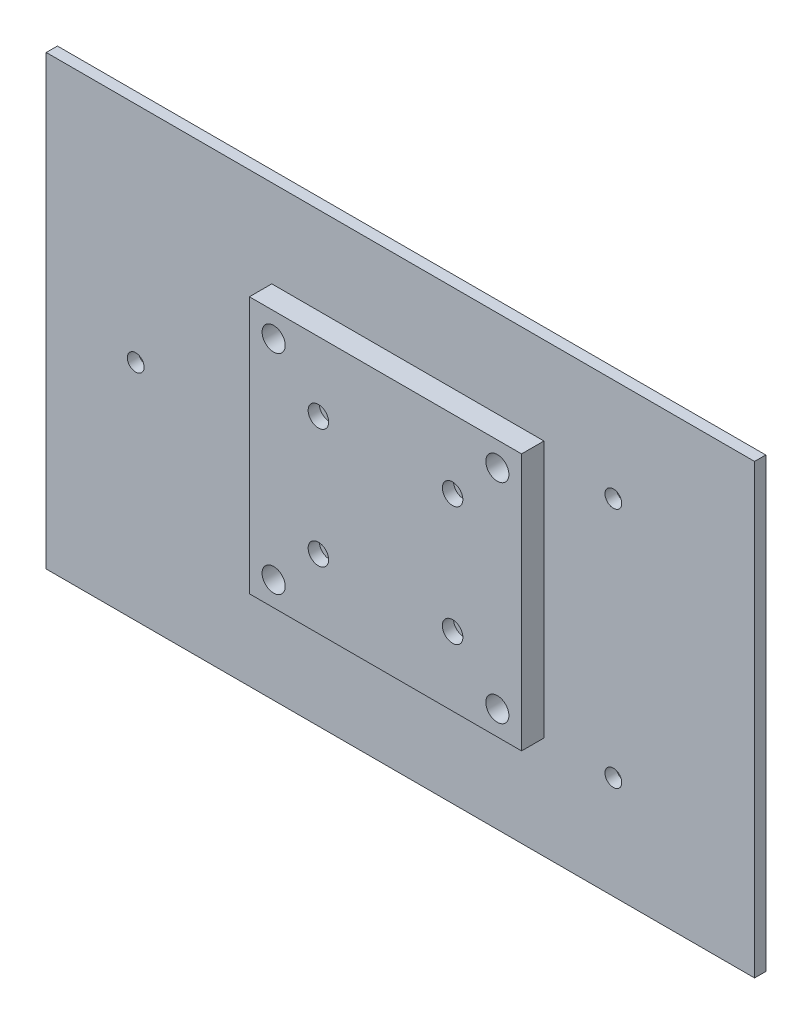
ISO-10303-21;
HEADER;
FILE_DESCRIPTION(('STEP AP214'),'2;1');
FILE_NAME('part.step','',(''),(''),'','','');
FILE_SCHEMA(('AUTOMOTIVE_DESIGN { 1 0 10303 214 1 1 1 1 }'));
ENDSEC;
DATA;
#1=APPLICATION_CONTEXT('core data for automotive mechanical design processes');
#2=APPLICATION_PROTOCOL_DEFINITION('international standard','automotive_design',2000,#1);
#3=PRODUCT_CONTEXT('',#1,'mechanical');
#4=PRODUCT('Part','Part','',(#3));
#5=PRODUCT_RELATED_PRODUCT_CATEGORY('part','',(#4));
#6=PRODUCT_DEFINITION_FORMATION('','',#4);
#7=PRODUCT_DEFINITION_CONTEXT('part definition',#1,'design');
#8=PRODUCT_DEFINITION('design','',#6,#7);
#9=PRODUCT_DEFINITION_SHAPE('','',#8);
#10=(LENGTH_UNIT() NAMED_UNIT(*) SI_UNIT(.MILLI.,.METRE.));
#11=(NAMED_UNIT(*) PLANE_ANGLE_UNIT() SI_UNIT($,.RADIAN.));
#12=(NAMED_UNIT(*) SI_UNIT($,.STERADIAN.) SOLID_ANGLE_UNIT());
#13=UNCERTAINTY_MEASURE_WITH_UNIT(LENGTH_MEASURE(1.E-05),#10,'distance_accuracy_value','');
#14=(GEOMETRIC_REPRESENTATION_CONTEXT(3) GLOBAL_UNCERTAINTY_ASSIGNED_CONTEXT((#13)) GLOBAL_UNIT_ASSIGNED_CONTEXT((#10,
#11,#12)) REPRESENTATION_CONTEXT('',''));
#15=CARTESIAN_POINT('',(0.,0.,0.));
#16=DIRECTION('',(0.,0.,1.));
#17=DIRECTION('',(1.,0.,0.));
#18=AXIS2_PLACEMENT_3D('',#15,#16,#17);
#19=CARTESIAN_POINT('',(18.5,50.5,6.));
#20=DIRECTION('',(0.,0.,-1.));
#21=DIRECTION('',(-1.,0.,0.));
#22=AXIS2_PLACEMENT_3D('',#19,#20,#21);
#23=CYLINDRICAL_SURFACE('',#22,1.25);
#24=CARTESIAN_POINT('',(18.5,50.5,-3.));
#25=DIRECTION('',(0.,0.,-1.));
#26=DIRECTION('',(-1.,0.,0.));
#27=AXIS2_PLACEMENT_3D('',#24,#25,#26);
#28=CIRCLE('',#27,1.25);
#29=CARTESIAN_POINT('',(17.25,50.5,-3.));
#30=VERTEX_POINT('',#29);
#31=EDGE_CURVE('E197',#30,#30,#28,.T.);
#32=ORIENTED_EDGE('',*,*,#31,.T.);
#33=EDGE_LOOP('',(#32));
#34=FACE_BOUND('',#33,.T.);
#35=CARTESIAN_POINT('',(18.5,50.5,3.));
#36=DIRECTION('',(0.,0.,1.));
#37=DIRECTION('',(1.,0.,0.));
#38=AXIS2_PLACEMENT_3D('',#35,#36,#37);
#39=CIRCLE('',#38,1.25);
#40=CARTESIAN_POINT('',(19.75,50.5,3.));
#41=VERTEX_POINT('',#40);
#42=EDGE_CURVE('E36',#41,#41,#39,.T.);
#43=ORIENTED_EDGE('',*,*,#42,.T.);
#44=EDGE_LOOP('',(#43));
#45=FACE_BOUND('',#44,.T.);
#46=ADVANCED_FACE('F32',(#34,#45),#23,.F.);
#47=CARTESIAN_POINT('',(54.5,50.5,6.));
#48=DIRECTION('',(0.,0.,-1.));
#49=DIRECTION('',(-1.,0.,0.));
#50=AXIS2_PLACEMENT_3D('',#47,#48,#49);
#51=CYLINDRICAL_SURFACE('',#50,1.25);
#52=CARTESIAN_POINT('',(54.5,50.5,-3.));
#53=DIRECTION('',(0.,0.,-1.));
#54=DIRECTION('',(-1.,0.,0.));
#55=AXIS2_PLACEMENT_3D('',#52,#53,#54);
#56=CIRCLE('',#55,1.25);
#57=CARTESIAN_POINT('',(53.25,50.5,-3.));
#58=VERTEX_POINT('',#57);
#59=EDGE_CURVE('E205',#58,#58,#56,.T.);
#60=ORIENTED_EDGE('',*,*,#59,.T.);
#61=EDGE_LOOP('',(#60));
#62=FACE_BOUND('',#61,.T.);
#63=CARTESIAN_POINT('',(54.5,50.5,3.));
#64=DIRECTION('',(0.,0.,1.));
#65=DIRECTION('',(1.,0.,0.));
#66=AXIS2_PLACEMENT_3D('',#63,#64,#65);
#67=CIRCLE('',#66,1.25);
#68=CARTESIAN_POINT('',(55.75,50.5,3.));
#69=VERTEX_POINT('',#68);
#70=EDGE_CURVE('E183',#69,#69,#67,.T.);
#71=ORIENTED_EDGE('',*,*,#70,.T.);
#72=EDGE_LOOP('',(#71));
#73=FACE_BOUND('',#72,.T.);
#74=ADVANCED_FACE('F280',(#62,#73),#51,.F.);
#75=CARTESIAN_POINT('',(54.5,18.5,6.));
#76=DIRECTION('',(0.,0.,-1.));
#77=DIRECTION('',(-1.,0.,0.));
#78=AXIS2_PLACEMENT_3D('',#75,#76,#77);
#79=CYLINDRICAL_SURFACE('',#78,1.25);
#80=CARTESIAN_POINT('',(54.5,18.5,-3.));
#81=DIRECTION('',(0.,0.,-1.));
#82=DIRECTION('',(-1.,0.,0.));
#83=AXIS2_PLACEMENT_3D('',#80,#81,#82);
#84=CIRCLE('',#83,1.25);
#85=CARTESIAN_POINT('',(53.25,18.5,-3.));
#86=VERTEX_POINT('',#85);
#87=EDGE_CURVE('E188',#86,#86,#84,.T.);
#88=ORIENTED_EDGE('',*,*,#87,.T.);
#89=EDGE_LOOP('',(#88));
#90=FACE_BOUND('',#89,.T.);
#91=CARTESIAN_POINT('',(54.5,18.5,3.));
#92=DIRECTION('',(0.,0.,1.));
#93=DIRECTION('',(1.,0.,0.));
#94=AXIS2_PLACEMENT_3D('',#91,#92,#93);
#95=CIRCLE('',#94,1.25);
#96=CARTESIAN_POINT('',(55.75,18.5,3.));
#97=VERTEX_POINT('',#96);
#98=EDGE_CURVE('E180',#97,#97,#95,.T.);
#99=ORIENTED_EDGE('',*,*,#98,.T.);
#100=EDGE_LOOP('',(#99));
#101=FACE_BOUND('',#100,.T.);
#102=ADVANCED_FACE('F286',(#90,#101),#79,.F.);
#103=CARTESIAN_POINT('',(18.5,18.5,6.));
#104=DIRECTION('',(0.,0.,-1.));
#105=DIRECTION('',(-1.,0.,0.));
#106=AXIS2_PLACEMENT_3D('',#103,#104,#105);
#107=CYLINDRICAL_SURFACE('',#106,1.25);
#108=CARTESIAN_POINT('',(18.5,18.5,-3.));
#109=DIRECTION('',(0.,0.,-1.));
#110=DIRECTION('',(-1.,0.,0.));
#111=AXIS2_PLACEMENT_3D('',#108,#109,#110);
#112=CIRCLE('',#111,1.25);
#113=CARTESIAN_POINT('',(17.25,18.5,-3.));
#114=VERTEX_POINT('',#113);
#115=EDGE_CURVE('E192',#114,#114,#112,.T.);
#116=ORIENTED_EDGE('',*,*,#115,.T.);
#117=EDGE_LOOP('',(#116));
#118=FACE_BOUND('',#117,.T.);
#119=CARTESIAN_POINT('',(18.5,18.5,3.));
#120=DIRECTION('',(0.,0.,1.));
#121=DIRECTION('',(1.,0.,0.));
#122=AXIS2_PLACEMENT_3D('',#119,#120,#121);
#123=CIRCLE('',#122,1.25);
#124=CARTESIAN_POINT('',(19.75,18.5,3.));
#125=VERTEX_POINT('',#124);
#126=EDGE_CURVE('E177',#125,#125,#123,.T.);
#127=ORIENTED_EDGE('',*,*,#126,.T.);
#128=EDGE_LOOP('',(#127));
#129=FACE_BOUND('',#128,.T.);
#130=ADVANCED_FACE('F317',(#118,#129),#107,.F.);
#131=CARTESIAN_POINT('',(0.,0.,0.));
#132=DIRECTION('',(0.,0.,-1.));
#133=DIRECTION('',(-1.,0.,0.));
#134=AXIS2_PLACEMENT_3D('',#131,#132,#133);
#135=PLANE('',#134);
#136=CARTESIAN_POINT('',(6.5,6.5,0.));
#137=DIRECTION('',(0.,0.,1.));
#138=DIRECTION('',(1.,0.,0.));
#139=AXIS2_PLACEMENT_3D('',#136,#137,#138);
#140=CIRCLE('',#139,3.1);
#141=CARTESIAN_POINT('',(9.6,6.5,0.));
#142=VERTEX_POINT('',#141);
#143=EDGE_CURVE('E142',#142,#142,#140,.T.);
#144=ORIENTED_EDGE('',*,*,#143,.T.);
#145=EDGE_LOOP('',(#144));
#146=FACE_BOUND('',#145,.T.);
#147=CARTESIAN_POINT('',(6.5,6.5,0.));
#148=DIRECTION('',(0.,0.,-1.));
#149=DIRECTION('',(-1.,0.,0.));
#150=AXIS2_PLACEMENT_3D('',#147,#148,#149);
#151=CIRCLE('',#150,5.);
#152=CARTESIAN_POINT('',(1.5,6.5,0.));
#153=VERTEX_POINT('',#152);
#154=EDGE_CURVE('E212',#153,#153,#151,.T.);
#155=ORIENTED_EDGE('',*,*,#154,.T.);
#156=EDGE_LOOP('',(#155));
#157=FACE_BOUND('',#156,.T.);
#158=ADVANCED_FACE('F313',(#146,#157),#135,.T.);
#159=CARTESIAN_POINT('',(66.5,62.5,0.));
#160=DIRECTION('',(0.,0.,1.));
#161=DIRECTION('',(1.,0.,0.));
#162=AXIS2_PLACEMENT_3D('',#159,#160,#161);
#163=CIRCLE('',#162,3.1);
#164=CARTESIAN_POINT('',(69.6,62.5,0.));
#165=VERTEX_POINT('',#164);
#166=EDGE_CURVE('E131',#165,#165,#163,.T.);
#167=ORIENTED_EDGE('',*,*,#166,.T.);
#168=EDGE_LOOP('',(#167));
#169=FACE_BOUND('',#168,.T.);
#170=CARTESIAN_POINT('',(66.5,62.5,0.));
#171=DIRECTION('',(0.,0.,-1.));
#172=DIRECTION('',(-1.,0.,0.));
#173=AXIS2_PLACEMENT_3D('',#170,#171,#172);
#174=CIRCLE('',#173,5.);
#175=CARTESIAN_POINT('',(61.5,62.5,0.));
#176=VERTEX_POINT('',#175);
#177=EDGE_CURVE('E224',#176,#176,#174,.T.);
#178=ORIENTED_EDGE('',*,*,#177,.T.);
#179=EDGE_LOOP('',(#178));
#180=FACE_BOUND('',#179,.T.);
#181=ADVANCED_FACE('F316',(#169,#180),#135,.T.);
#182=CARTESIAN_POINT('',(6.5,62.5,0.));
#183=DIRECTION('',(0.,0.,1.));
#184=DIRECTION('',(-1.,0.,0.));
#185=AXIS2_PLACEMENT_3D('',#182,#183,#184);
#186=CIRCLE('',#185,3.1);
#187=CARTESIAN_POINT('',(3.4,62.5,0.));
#188=VERTEX_POINT('',#187);
#189=EDGE_CURVE('E121',#188,#188,#186,.T.);
#190=ORIENTED_EDGE('',*,*,#189,.T.);
#191=EDGE_LOOP('',(#190));
#192=FACE_BOUND('',#191,.T.);
#193=CARTESIAN_POINT('',(6.5,62.5,0.));
#194=DIRECTION('',(0.,0.,-1.));
#195=DIRECTION('',(-1.,0.,0.));
#196=AXIS2_PLACEMENT_3D('',#193,#194,#195);
#197=CIRCLE('',#196,5.);
#198=CARTESIAN_POINT('',(1.5,62.5,0.));
#199=VERTEX_POINT('',#198);
#200=EDGE_CURVE('E218',#199,#199,#197,.T.);
#201=ORIENTED_EDGE('',*,*,#200,.T.);
#202=EDGE_LOOP('',(#201));
#203=FACE_BOUND('',#202,.T.);
#204=ADVANCED_FACE('F652',(#192,#203),#135,.T.);
#205=CARTESIAN_POINT('',(66.5,6.5,0.));
#206=DIRECTION('',(0.,0.,1.));
#207=DIRECTION('',(-1.,0.,0.));
#208=AXIS2_PLACEMENT_3D('',#205,#206,#207);
#209=CIRCLE('',#208,3.1);
#210=CARTESIAN_POINT('',(63.4,6.5,0.));
#211=VERTEX_POINT('',#210);
#212=EDGE_CURVE('E136',#211,#211,#209,.T.);
#213=ORIENTED_EDGE('',*,*,#212,.T.);
#214=EDGE_LOOP('',(#213));
#215=FACE_BOUND('',#214,.T.);
#216=CARTESIAN_POINT('',(66.5,6.5,0.));
#217=DIRECTION('',(0.,0.,-1.));
#218=DIRECTION('',(-1.,0.,0.));
#219=AXIS2_PLACEMENT_3D('',#216,#217,#218);
#220=CIRCLE('',#219,5.);
#221=CARTESIAN_POINT('',(61.5,6.5,0.));
#222=VERTEX_POINT('',#221);
#223=EDGE_CURVE('E208',#222,#222,#220,.T.);
#224=ORIENTED_EDGE('',*,*,#223,.T.);
#225=EDGE_LOOP('',(#224));
#226=FACE_BOUND('',#225,.T.);
#227=ADVANCED_FACE('F311',(#215,#226),#135,.T.);
#228=CARTESIAN_POINT('',(0.,0.,6.));
#229=DIRECTION('',(0.,0.,-1.));
#230=DIRECTION('',(-1.,0.,0.));
#231=AXIS2_PLACEMENT_3D('',#228,#229,#230);
#232=PLANE('',#231);
#233=CARTESIAN_POINT('',(18.5,18.5,6.));
#234=DIRECTION('',(0.,0.,1.));
#235=DIRECTION('',(1.,0.,0.));
#236=AXIS2_PLACEMENT_3D('',#233,#234,#235);
#237=CIRCLE('',#236,2.75);
#238=CARTESIAN_POINT('',(21.25,18.5,6.));
#239=VERTEX_POINT('',#238);
#240=EDGE_CURVE('E428',#239,#239,#237,.T.);
#241=ORIENTED_EDGE('',*,*,#240,.F.);
#242=EDGE_LOOP('',(#241));
#243=FACE_BOUND('',#242,.T.);
#244=CARTESIAN_POINT('',(54.5,18.5,6.));
#245=DIRECTION('',(0.,0.,1.));
#246=DIRECTION('',(1.,0.,0.));
#247=AXIS2_PLACEMENT_3D('',#244,#245,#246);
#248=CIRCLE('',#247,2.75);
#249=CARTESIAN_POINT('',(57.25,18.5,6.));
#250=VERTEX_POINT('',#249);
#251=EDGE_CURVE('E422',#250,#250,#248,.T.);
#252=ORIENTED_EDGE('',*,*,#251,.F.);
#253=EDGE_LOOP('',(#252));
#254=FACE_BOUND('',#253,.T.);
#255=CARTESIAN_POINT('',(54.5,50.5,6.));
#256=DIRECTION('',(0.,0.,1.));
#257=DIRECTION('',(1.,0.,0.));
#258=AXIS2_PLACEMENT_3D('',#255,#256,#257);
#259=CIRCLE('',#258,2.75);
#260=CARTESIAN_POINT('',(57.25,50.5,6.));
#261=VERTEX_POINT('',#260);
#262=EDGE_CURVE('E413',#261,#261,#259,.T.);
#263=ORIENTED_EDGE('',*,*,#262,.F.);
#264=EDGE_LOOP('',(#263));
#265=FACE_BOUND('',#264,.T.);
#266=CARTESIAN_POINT('',(18.5,50.5,6.));
#267=DIRECTION('',(0.,0.,1.));
#268=DIRECTION('',(1.,0.,0.));
#269=AXIS2_PLACEMENT_3D('',#266,#267,#268);
#270=CIRCLE('',#269,2.75);
#271=CARTESIAN_POINT('',(21.25,50.5,6.));
#272=VERTEX_POINT('',#271);
#273=EDGE_CURVE('E200',#272,#272,#270,.T.);
#274=ORIENTED_EDGE('',*,*,#273,.F.);
#275=EDGE_LOOP('',(#274));
#276=FACE_BOUND('',#275,.T.);
#277=DIRECTION('',(0.,-1.,0.));
#278=VECTOR('',#277,1.);
#279=CARTESIAN_POINT('',(0.,0.,6.));
#280=LINE('',#279,#278);
#281=CARTESIAN_POINT('',(0.,69.,6.));
#282=VERTEX_POINT('',#281);
#283=CARTESIAN_POINT('',(0.,0.,6.));
#284=VERTEX_POINT('',#283);
#285=EDGE_CURVE('E151',#282,#284,#280,.T.);
#286=ORIENTED_EDGE('',*,*,#285,.T.);
#287=DIRECTION('',(1.,0.,0.));
#288=VECTOR('',#287,1.);
#289=CARTESIAN_POINT('',(0.,0.,6.));
#290=LINE('',#289,#288);
#291=CARTESIAN_POINT('',(73.,0.,6.));
#292=VERTEX_POINT('',#291);
#293=EDGE_CURVE('E153',#284,#292,#290,.T.);
#294=ORIENTED_EDGE('',*,*,#293,.T.);
#295=DIRECTION('',(0.,1.,0.));
#296=VECTOR('',#295,1.);
#297=CARTESIAN_POINT('',(73.,0.,6.));
#298=LINE('',#297,#296);
#299=CARTESIAN_POINT('',(73.,69.,6.));
#300=VERTEX_POINT('',#299);
#301=EDGE_CURVE('E156',#292,#300,#298,.T.);
#302=ORIENTED_EDGE('',*,*,#301,.T.);
#303=DIRECTION('',(-1.,0.,0.));
#304=VECTOR('',#303,1.);
#305=CARTESIAN_POINT('',(0.,69.,6.));
#306=LINE('',#305,#304);
#307=EDGE_CURVE('E50',#300,#282,#306,.T.);
#308=ORIENTED_EDGE('',*,*,#307,.T.);
#309=EDGE_LOOP('',(#286,#294,#302,#308));
#310=FACE_BOUND('',#309,.T.);
#311=CARTESIAN_POINT('',(6.5,6.5,6.));
#312=DIRECTION('',(0.,0.,1.));
#313=DIRECTION('',(1.,0.,0.));
#314=AXIS2_PLACEMENT_3D('',#311,#312,#313);
#315=CIRCLE('',#314,3.1);
#316=CARTESIAN_POINT('',(9.6,6.5,6.));
#317=VERTEX_POINT('',#316);
#318=EDGE_CURVE('E145',#317,#317,#315,.T.);
#319=ORIENTED_EDGE('',*,*,#318,.F.);
#320=EDGE_LOOP('',(#319));
#321=FACE_BOUND('',#320,.T.);
#322=CARTESIAN_POINT('',(66.5,6.5,6.));
#323=DIRECTION('',(0.,0.,1.));
#324=DIRECTION('',(-1.,0.,0.));
#325=AXIS2_PLACEMENT_3D('',#322,#323,#324);
#326=CIRCLE('',#325,3.1);
#327=CARTESIAN_POINT('',(63.4,6.5,6.));
#328=VERTEX_POINT('',#327);
#329=EDGE_CURVE('E139',#328,#328,#326,.T.);
#330=ORIENTED_EDGE('',*,*,#329,.F.);
#331=EDGE_LOOP('',(#330));
#332=FACE_BOUND('',#331,.T.);
#333=CARTESIAN_POINT('',(66.5,62.5,6.));
#334=DIRECTION('',(0.,0.,1.));
#335=DIRECTION('',(1.,0.,0.));
#336=AXIS2_PLACEMENT_3D('',#333,#334,#335);
#337=CIRCLE('',#336,3.1);
#338=CARTESIAN_POINT('',(69.6,62.5,6.));
#339=VERTEX_POINT('',#338);
#340=EDGE_CURVE('E133',#339,#339,#337,.T.);
#341=ORIENTED_EDGE('',*,*,#340,.F.);
#342=EDGE_LOOP('',(#341));
#343=FACE_BOUND('',#342,.T.);
#344=CARTESIAN_POINT('',(6.5,62.5,6.));
#345=DIRECTION('',(0.,0.,1.));
#346=DIRECTION('',(-1.,0.,0.));
#347=AXIS2_PLACEMENT_3D('',#344,#345,#346);
#348=CIRCLE('',#347,3.1);
#349=CARTESIAN_POINT('',(3.4,62.5,6.));
#350=VERTEX_POINT('',#349);
#351=EDGE_CURVE('E124',#350,#350,#348,.T.);
#352=ORIENTED_EDGE('',*,*,#351,.F.);
#353=EDGE_LOOP('',(#352));
#354=FACE_BOUND('',#353,.T.);
#355=ADVANCED_FACE('F308',(#243,#254,#265,#276,#310,#321,#332,#343,#354),#232,.F.);
#356=CARTESIAN_POINT('',(0.,0.,6.));
#357=DIRECTION('',(1.,0.,0.));
#358=DIRECTION('',(0.,0.,-1.));
#359=AXIS2_PLACEMENT_3D('',#356,#357,#358);
#360=PLANE('',#359);
#361=DIRECTION('',(0.,-1.,0.));
#362=VECTOR('',#361,1.);
#363=CARTESIAN_POINT('',(0.,0.,0.));
#364=LINE('',#363,#362);
#365=CARTESIAN_POINT('',(0.,69.,0.));
#366=VERTEX_POINT('',#365);
#367=CARTESIAN_POINT('',(0.,0.,0.));
#368=VERTEX_POINT('',#367);
#369=EDGE_CURVE('E148',#366,#368,#364,.T.);
#370=ORIENTED_EDGE('',*,*,#369,.T.);
#371=DIRECTION('',(0.,0.,-1.));
#372=VECTOR('',#371,1.);
#373=CARTESIAN_POINT('',(0.,0.,6.));
#374=LINE('',#373,#372);
#375=EDGE_CURVE('E11',#284,#368,#374,.T.);
#376=ORIENTED_EDGE('',*,*,#375,.F.);
#377=ORIENTED_EDGE('',*,*,#285,.F.);
#378=DIRECTION('',(0.,0.,-1.));
#379=VECTOR('',#378,1.);
#380=CARTESIAN_POINT('',(0.,69.,6.));
#381=LINE('',#380,#379);
#382=EDGE_CURVE('E159',#282,#366,#381,.T.);
#383=ORIENTED_EDGE('',*,*,#382,.T.);
#384=EDGE_LOOP('',(#370,#376,#377,#383));
#385=FACE_BOUND('',#384,.T.);
#386=ADVANCED_FACE('F34',(#385),#360,.F.);
#387=CARTESIAN_POINT('',(0.,0.,6.));
#388=DIRECTION('',(0.,1.,0.));
#389=DIRECTION('',(0.,0.,1.));
#390=AXIS2_PLACEMENT_3D('',#387,#388,#389);
#391=PLANE('',#390);
#392=DIRECTION('',(1.,0.,0.));
#393=VECTOR('',#392,1.);
#394=CARTESIAN_POINT('',(0.,0.,0.));
#395=LINE('',#394,#393);
#396=CARTESIAN_POINT('',(73.,0.,0.));
#397=VERTEX_POINT('',#396);
#398=EDGE_CURVE('E162',#368,#397,#395,.T.);
#399=ORIENTED_EDGE('',*,*,#398,.T.);
#400=DIRECTION('',(0.,0.,-1.));
#401=VECTOR('',#400,1.);
#402=CARTESIAN_POINT('',(73.,0.,6.));
#403=LINE('',#402,#401);
#404=EDGE_CURVE('E42',#292,#397,#403,.T.);
#405=ORIENTED_EDGE('',*,*,#404,.F.);
#406=ORIENTED_EDGE('',*,*,#293,.F.);
#407=ORIENTED_EDGE('',*,*,#375,.T.);
#408=EDGE_LOOP('',(#399,#405,#406,#407));
#409=FACE_BOUND('',#408,.T.);
#410=ADVANCED_FACE('F324',(#409),#391,.F.);
#411=CARTESIAN_POINT('',(73.,0.,6.));
#412=DIRECTION('',(-1.,0.,0.));
#413=DIRECTION('',(0.,0.,1.));
#414=AXIS2_PLACEMENT_3D('',#411,#412,#413);
#415=PLANE('',#414);
#416=DIRECTION('',(0.,1.,0.));
#417=VECTOR('',#416,1.);
#418=CARTESIAN_POINT('',(73.,0.,0.));
#419=LINE('',#418,#417);
#420=CARTESIAN_POINT('',(73.,69.,0.));
#421=VERTEX_POINT('',#420);
#422=EDGE_CURVE('E165',#397,#421,#419,.T.);
#423=ORIENTED_EDGE('',*,*,#422,.T.);
#424=DIRECTION('',(0.,0.,-1.));
#425=VECTOR('',#424,1.);
#426=CARTESIAN_POINT('',(73.,69.,6.));
#427=LINE('',#426,#425);
#428=EDGE_CURVE('E172',#300,#421,#427,.T.);
#429=ORIENTED_EDGE('',*,*,#428,.F.);
#430=ORIENTED_EDGE('',*,*,#301,.F.);
#431=ORIENTED_EDGE('',*,*,#404,.T.);
#432=EDGE_LOOP('',(#423,#429,#430,#431));
#433=FACE_BOUND('',#432,.T.);
#434=ADVANCED_FACE('F321',(#433),#415,.F.);
#435=CARTESIAN_POINT('',(0.,69.,6.));
#436=DIRECTION('',(0.,-1.,0.));
#437=DIRECTION('',(0.,0.,-1.));
#438=AXIS2_PLACEMENT_3D('',#435,#436,#437);
#439=PLANE('',#438);
#440=DIRECTION('',(-1.,0.,0.));
#441=VECTOR('',#440,1.);
#442=CARTESIAN_POINT('',(0.,69.,0.));
#443=LINE('',#442,#441);
#444=EDGE_CURVE('E154',#421,#366,#443,.T.);
#445=ORIENTED_EDGE('',*,*,#444,.T.);
#446=ORIENTED_EDGE('',*,*,#382,.F.);
#447=ORIENTED_EDGE('',*,*,#307,.F.);
#448=ORIENTED_EDGE('',*,*,#428,.T.);
#449=EDGE_LOOP('',(#445,#446,#447,#448));
#450=FACE_BOUND('',#449,.T.);
#451=ADVANCED_FACE('F306',(#450),#439,.F.);
#452=CARTESIAN_POINT('',(6.5,6.5,6.));
#453=DIRECTION('',(0.,0.,-1.));
#454=DIRECTION('',(-1.,0.,0.));
#455=AXIS2_PLACEMENT_3D('',#452,#453,#454);
#456=CYLINDRICAL_SURFACE('',#455,3.1);
#457=ORIENTED_EDGE('',*,*,#318,.T.);
#458=EDGE_LOOP('',(#457));
#459=FACE_BOUND('',#458,.T.);
#460=ORIENTED_EDGE('',*,*,#143,.F.);
#461=EDGE_LOOP('',(#460));
#462=FACE_BOUND('',#461,.T.);
#463=ADVANCED_FACE('F302',(#459,#462),#456,.F.);
#464=CARTESIAN_POINT('',(66.5,6.5,6.));
#465=DIRECTION('',(0.,0.,-1.));
#466=DIRECTION('',(-1.,0.,0.));
#467=AXIS2_PLACEMENT_3D('',#464,#465,#466);
#468=CYLINDRICAL_SURFACE('',#467,3.1);
#469=ORIENTED_EDGE('',*,*,#329,.T.);
#470=EDGE_LOOP('',(#469));
#471=FACE_BOUND('',#470,.T.);
#472=ORIENTED_EDGE('',*,*,#212,.F.);
#473=EDGE_LOOP('',(#472));
#474=FACE_BOUND('',#473,.T.);
#475=ADVANCED_FACE('F298',(#471,#474),#468,.F.);
#476=CARTESIAN_POINT('',(66.5,62.5,6.));
#477=DIRECTION('',(0.,0.,-1.));
#478=DIRECTION('',(-1.,0.,0.));
#479=AXIS2_PLACEMENT_3D('',#476,#477,#478);
#480=CYLINDRICAL_SURFACE('',#479,3.1);
#481=ORIENTED_EDGE('',*,*,#340,.T.);
#482=EDGE_LOOP('',(#481));
#483=FACE_BOUND('',#482,.T.);
#484=ORIENTED_EDGE('',*,*,#166,.F.);
#485=EDGE_LOOP('',(#484));
#486=FACE_BOUND('',#485,.T.);
#487=ADVANCED_FACE('F294',(#483,#486),#480,.F.);
#488=CARTESIAN_POINT('',(6.5,62.5,6.));
#489=DIRECTION('',(0.,0.,-1.));
#490=DIRECTION('',(-1.,0.,0.));
#491=AXIS2_PLACEMENT_3D('',#488,#489,#490);
#492=CYLINDRICAL_SURFACE('',#491,3.1);
#493=ORIENTED_EDGE('',*,*,#351,.T.);
#494=EDGE_LOOP('',(#493));
#495=FACE_BOUND('',#494,.T.);
#496=ORIENTED_EDGE('',*,*,#189,.F.);
#497=EDGE_LOOP('',(#496));
#498=FACE_BOUND('',#497,.T.);
#499=ADVANCED_FACE('F291',(#495,#498),#492,.F.);
#500=CARTESIAN_POINT('',(0.,0.,0.));
#501=DIRECTION('',(0.,0.,1.));
#502=DIRECTION('',(1.,0.,0.));
#503=AXIS2_PLACEMENT_3D('',#500,#501,#502);
#504=PLANE('',#503);
#505=CARTESIAN_POINT('',(91.6231990769086,64.9307401439221,0.));
#506=DIRECTION('',(0.,0.,-1.));
#507=DIRECTION('',(-1.,0.,0.));
#508=AXIS2_PLACEMENT_3D('',#505,#506,#507);
#509=CIRCLE('',#508,2.24999999999967);
#510=CARTESIAN_POINT('',(89.3731990769089,64.9307401439221,0.));
#511=VERTEX_POINT('',#510);
#512=EDGE_CURVE('E230',#511,#511,#509,.T.);
#513=ORIENTED_EDGE('',*,*,#512,.T.);
#514=EDGE_LOOP('',(#513));
#515=FACE_BOUND('',#514,.T.);
#516=CARTESIAN_POINT('',(-36.4999999999996,32.5000000000007,0.));
#517=DIRECTION('',(0.,0.,-1.));
#518=DIRECTION('',(-1.,0.,0.));
#519=AXIS2_PLACEMENT_3D('',#516,#517,#518);
#520=CIRCLE('',#519,2.25000000000004);
#521=CARTESIAN_POINT('',(-38.7499999999997,32.5000000000007,0.));
#522=VERTEX_POINT('',#521);
#523=EDGE_CURVE('E242',#522,#522,#520,.T.);
#524=ORIENTED_EDGE('',*,*,#523,.T.);
#525=EDGE_LOOP('',(#524));
#526=FACE_BOUND('',#525,.T.);
#527=DIRECTION('',(0.,-1.,0.));
#528=VECTOR('',#527,1.);
#529=CARTESIAN_POINT('',(129.499999999995,92.5000000000001,0.));
#530=LINE('',#529,#528);
#531=CARTESIAN_POINT('',(129.499999999995,92.5000000000001,0.));
#532=VERTEX_POINT('',#531);
#533=CARTESIAN_POINT('',(129.499999999995,-27.4999999999999,0.));
#534=VERTEX_POINT('',#533);
#535=EDGE_CURVE('E120',#532,#534,#530,.T.);
#536=ORIENTED_EDGE('',*,*,#535,.F.);
#537=DIRECTION('',(1.,0.,0.));
#538=VECTOR('',#537,1.);
#539=CARTESIAN_POINT('',(-60.4999999999942,92.5000000000007,0.));
#540=LINE('',#539,#538);
#541=CARTESIAN_POINT('',(-60.4999999999942,92.5000000000007,0.));
#542=VERTEX_POINT('',#541);
#543=EDGE_CURVE('E116',#542,#532,#540,.T.);
#544=ORIENTED_EDGE('',*,*,#543,.F.);
#545=DIRECTION('',(0.,1.,0.));
#546=VECTOR('',#545,1.);
#547=CARTESIAN_POINT('',(-60.4999999999949,-27.4999999999992,0.));
#548=LINE('',#547,#546);
#549=CARTESIAN_POINT('',(-60.4999999999949,-27.4999999999992,0.));
#550=VERTEX_POINT('',#549);
#551=EDGE_CURVE('E256',#550,#542,#548,.T.);
#552=ORIENTED_EDGE('',*,*,#551,.F.);
#553=DIRECTION('',(-1.,0.,0.));
#554=VECTOR('',#553,1.);
#555=CARTESIAN_POINT('',(-60.4999999999949,-27.4999999999992,0.));
#556=LINE('',#555,#554);
#557=EDGE_CURVE('E254',#534,#550,#556,.T.);
#558=ORIENTED_EDGE('',*,*,#557,.F.);
#559=EDGE_LOOP('',(#536,#544,#552,#558));
#560=FACE_BOUND('',#559,.T.);
#561=CARTESIAN_POINT('',(91.6231990769086,0.0692598560788349,0.));
#562=DIRECTION('',(0.,0.,-1.));
#563=DIRECTION('',(-1.,0.,0.));
#564=AXIS2_PLACEMENT_3D('',#561,#562,#563);
#565=CIRCLE('',#564,2.2500000000002);
#566=CARTESIAN_POINT('',(89.3731990769084,0.0692598560788349,0.));
#567=VERTEX_POINT('',#566);
#568=EDGE_CURVE('E236',#567,#567,#565,.T.);
#569=ORIENTED_EDGE('',*,*,#568,.T.);
#570=EDGE_LOOP('',(#569));
#571=FACE_BOUND('',#570,.T.);
#572=ORIENTED_EDGE('',*,*,#369,.F.);
#573=ORIENTED_EDGE('',*,*,#444,.F.);
#574=ORIENTED_EDGE('',*,*,#422,.F.);
#575=ORIENTED_EDGE('',*,*,#398,.F.);
#576=EDGE_LOOP('',(#572,#573,#574,#575));
#577=FACE_BOUND('',#576,.T.);
#578=ADVANCED_FACE('F267',(#515,#526,#560,#571,#577),#504,.T.);
#579=CARTESIAN_POINT('',(0.,0.,-3.));
#580=DIRECTION('',(0.,0.,1.));
#581=DIRECTION('',(1.,0.,0.));
#582=AXIS2_PLACEMENT_3D('',#579,#580,#581);
#583=PLANE('',#582);
#584=DIRECTION('',(0.,-1.,0.));
#585=VECTOR('',#584,1.);
#586=CARTESIAN_POINT('',(129.499999999995,92.5000000000001,-3.));
#587=LINE('',#586,#585);
#588=CARTESIAN_POINT('',(129.499999999995,92.5000000000001,-3.));
#589=VERTEX_POINT('',#588);
#590=CARTESIAN_POINT('',(129.499999999995,-27.4999999999999,-3.));
#591=VERTEX_POINT('',#590);
#592=EDGE_CURVE('E106',#589,#591,#587,.T.);
#593=ORIENTED_EDGE('',*,*,#592,.T.);
#594=DIRECTION('',(-1.,0.,0.));
#595=VECTOR('',#594,1.);
#596=CARTESIAN_POINT('',(-60.4999999999949,-27.4999999999992,-3.));
#597=LINE('',#596,#595);
#598=CARTESIAN_POINT('',(-60.4999999999949,-27.4999999999992,-3.));
#599=VERTEX_POINT('',#598);
#600=EDGE_CURVE('E95',#591,#599,#597,.T.);
#601=ORIENTED_EDGE('',*,*,#600,.T.);
#602=DIRECTION('',(0.,1.,0.));
#603=VECTOR('',#602,1.);
#604=CARTESIAN_POINT('',(-60.4999999999949,-27.4999999999992,-3.));
#605=LINE('',#604,#603);
#606=CARTESIAN_POINT('',(-60.4999999999942,92.5000000000007,-3.));
#607=VERTEX_POINT('',#606);
#608=EDGE_CURVE('E105',#599,#607,#605,.T.);
#609=ORIENTED_EDGE('',*,*,#608,.T.);
#610=DIRECTION('',(1.,0.,0.));
#611=VECTOR('',#610,1.);
#612=CARTESIAN_POINT('',(-60.4999999999942,92.5000000000007,-3.));
#613=LINE('',#612,#611);
#614=EDGE_CURVE('E112',#607,#589,#613,.T.);
#615=ORIENTED_EDGE('',*,*,#614,.T.);
#616=EDGE_LOOP('',(#593,#601,#609,#615));
#617=FACE_BOUND('',#616,.T.);
#618=CARTESIAN_POINT('',(-36.4999999999996,32.5000000000007,-3.));
#619=DIRECTION('',(0.,0.,-1.));
#620=DIRECTION('',(-1.,0.,0.));
#621=AXIS2_PLACEMENT_3D('',#618,#619,#620);
#622=CIRCLE('',#621,2.25000000000004);
#623=CARTESIAN_POINT('',(-38.7499999999997,32.5000000000007,-3.));
#624=VERTEX_POINT('',#623);
#625=EDGE_CURVE('E245',#624,#624,#622,.T.);
#626=ORIENTED_EDGE('',*,*,#625,.F.);
#627=EDGE_LOOP('',(#626));
#628=FACE_BOUND('',#627,.T.);
#629=CARTESIAN_POINT('',(91.6231990769086,0.0692598560788349,-3.));
#630=DIRECTION('',(0.,0.,-1.));
#631=DIRECTION('',(-1.,0.,0.));
#632=AXIS2_PLACEMENT_3D('',#629,#630,#631);
#633=CIRCLE('',#632,2.2500000000002);
#634=CARTESIAN_POINT('',(89.3731990769084,0.0692598560788349,-3.));
#635=VERTEX_POINT('',#634);
#636=EDGE_CURVE('E239',#635,#635,#633,.T.);
#637=ORIENTED_EDGE('',*,*,#636,.F.);
#638=EDGE_LOOP('',(#637));
#639=FACE_BOUND('',#638,.T.);
#640=CARTESIAN_POINT('',(91.6231990769086,64.9307401439221,-3.));
#641=DIRECTION('',(0.,0.,-1.));
#642=DIRECTION('',(-1.,0.,0.));
#643=AXIS2_PLACEMENT_3D('',#640,#641,#642);
#644=CIRCLE('',#643,2.24999999999967);
#645=CARTESIAN_POINT('',(89.3731990769089,64.9307401439221,-3.));
#646=VERTEX_POINT('',#645);
#647=EDGE_CURVE('E233',#646,#646,#644,.T.);
#648=ORIENTED_EDGE('',*,*,#647,.F.);
#649=EDGE_LOOP('',(#648));
#650=FACE_BOUND('',#649,.T.);
#651=CARTESIAN_POINT('',(66.5,62.5,-3.));
#652=DIRECTION('',(0.,0.,-1.));
#653=DIRECTION('',(-1.,0.,0.));
#654=AXIS2_PLACEMENT_3D('',#651,#652,#653);
#655=CIRCLE('',#654,5.);
#656=CARTESIAN_POINT('',(61.5,62.5,-3.));
#657=VERTEX_POINT('',#656);
#658=EDGE_CURVE('E227',#657,#657,#655,.T.);
#659=ORIENTED_EDGE('',*,*,#658,.F.);
#660=EDGE_LOOP('',(#659));
#661=FACE_BOUND('',#660,.T.);
#662=CARTESIAN_POINT('',(6.5,62.5,-3.));
#663=DIRECTION('',(0.,0.,-1.));
#664=DIRECTION('',(-1.,0.,0.));
#665=AXIS2_PLACEMENT_3D('',#662,#663,#664);
#666=CIRCLE('',#665,5.);
#667=CARTESIAN_POINT('',(1.5,62.5,-3.));
#668=VERTEX_POINT('',#667);
#669=EDGE_CURVE('E221',#668,#668,#666,.T.);
#670=ORIENTED_EDGE('',*,*,#669,.F.);
#671=EDGE_LOOP('',(#670));
#672=FACE_BOUND('',#671,.T.);
#673=CARTESIAN_POINT('',(6.5,6.5,-3.));
#674=DIRECTION('',(0.,0.,-1.));
#675=DIRECTION('',(-1.,0.,0.));
#676=AXIS2_PLACEMENT_3D('',#673,#674,#675);
#677=CIRCLE('',#676,5.);
#678=CARTESIAN_POINT('',(1.5,6.5,-3.));
#679=VERTEX_POINT('',#678);
#680=EDGE_CURVE('E215',#679,#679,#677,.T.);
#681=ORIENTED_EDGE('',*,*,#680,.F.);
#682=EDGE_LOOP('',(#681));
#683=FACE_BOUND('',#682,.T.);
#684=CARTESIAN_POINT('',(66.5,6.5,-3.));
#685=DIRECTION('',(0.,0.,-1.));
#686=DIRECTION('',(-1.,0.,0.));
#687=AXIS2_PLACEMENT_3D('',#684,#685,#686);
#688=CIRCLE('',#687,5.);
#689=CARTESIAN_POINT('',(61.5,6.5,-3.));
#690=VERTEX_POINT('',#689);
#691=EDGE_CURVE('E209',#690,#690,#688,.T.);
#692=ORIENTED_EDGE('',*,*,#691,.F.);
#693=EDGE_LOOP('',(#692));
#694=FACE_BOUND('',#693,.T.);
#695=ORIENTED_EDGE('',*,*,#59,.F.);
#696=EDGE_LOOP('',(#695));
#697=FACE_BOUND('',#696,.T.);
#698=ORIENTED_EDGE('',*,*,#31,.F.);
#699=EDGE_LOOP('',(#698));
#700=FACE_BOUND('',#699,.T.);
#701=ORIENTED_EDGE('',*,*,#115,.F.);
#702=EDGE_LOOP('',(#701));
#703=FACE_BOUND('',#702,.T.);
#704=ORIENTED_EDGE('',*,*,#87,.F.);
#705=EDGE_LOOP('',(#704));
#706=FACE_BOUND('',#705,.T.);
#707=ADVANCED_FACE('F109',(#617,#628,#639,#650,#661,#672,#683,#694,#697,#700,#703,#706),#583,.F.);
#708=CARTESIAN_POINT('',(129.499999999995,92.5000000000001,-3.));
#709=DIRECTION('',(-1.,0.,0.));
#710=DIRECTION('',(0.,-1.,0.));
#711=AXIS2_PLACEMENT_3D('',#708,#709,#710);
#712=PLANE('',#711);
#713=ORIENTED_EDGE('',*,*,#535,.T.);
#714=DIRECTION('',(0.,0.,1.));
#715=VECTOR('',#714,1.);
#716=CARTESIAN_POINT('',(129.499999999995,-27.4999999999999,-3.));
#717=LINE('',#716,#715);
#718=EDGE_CURVE('E99',#591,#534,#717,.T.);
#719=ORIENTED_EDGE('',*,*,#718,.F.);
#720=ORIENTED_EDGE('',*,*,#592,.F.);
#721=DIRECTION('',(0.,0.,1.));
#722=VECTOR('',#721,1.);
#723=CARTESIAN_POINT('',(129.499999999995,92.5000000000001,-3.));
#724=LINE('',#723,#722);
#725=EDGE_CURVE('E252',#589,#532,#724,.T.);
#726=ORIENTED_EDGE('',*,*,#725,.T.);
#727=EDGE_LOOP('',(#713,#719,#720,#726));
#728=FACE_BOUND('',#727,.T.);
#729=ADVANCED_FACE('F118',(#728),#712,.F.);
#730=CARTESIAN_POINT('',(-60.4999999999949,-27.4999999999992,-3.));
#731=DIRECTION('',(0.,1.,0.));
#732=DIRECTION('',(-1.,0.,0.));
#733=AXIS2_PLACEMENT_3D('',#730,#731,#732);
#734=PLANE('',#733);
#735=ORIENTED_EDGE('',*,*,#557,.T.);
#736=DIRECTION('',(0.,0.,1.));
#737=VECTOR('',#736,1.);
#738=CARTESIAN_POINT('',(-60.4999999999949,-27.4999999999992,-3.));
#739=LINE('',#738,#737);
#740=EDGE_CURVE('E102',#599,#550,#739,.T.);
#741=ORIENTED_EDGE('',*,*,#740,.F.);
#742=ORIENTED_EDGE('',*,*,#600,.F.);
#743=ORIENTED_EDGE('',*,*,#718,.T.);
#744=EDGE_LOOP('',(#735,#741,#742,#743));
#745=FACE_BOUND('',#744,.T.);
#746=ADVANCED_FACE('F97',(#745),#734,.F.);
#747=CARTESIAN_POINT('',(-60.4999999999949,-27.4999999999992,-3.));
#748=DIRECTION('',(1.,0.,0.));
#749=DIRECTION('',(0.,1.,0.));
#750=AXIS2_PLACEMENT_3D('',#747,#748,#749);
#751=PLANE('',#750);
#752=ORIENTED_EDGE('',*,*,#551,.T.);
#753=DIRECTION('',(0.,0.,1.));
#754=VECTOR('',#753,1.);
#755=CARTESIAN_POINT('',(-60.4999999999942,92.5000000000007,-3.));
#756=LINE('',#755,#754);
#757=EDGE_CURVE('E126',#607,#542,#756,.T.);
#758=ORIENTED_EDGE('',*,*,#757,.F.);
#759=ORIENTED_EDGE('',*,*,#608,.F.);
#760=ORIENTED_EDGE('',*,*,#740,.T.);
#761=EDGE_LOOP('',(#752,#758,#759,#760));
#762=FACE_BOUND('',#761,.T.);
#763=ADVANCED_FACE('F269',(#762),#751,.F.);
#764=CARTESIAN_POINT('',(-60.4999999999942,92.5000000000007,-3.));
#765=DIRECTION('',(0.,-1.,0.));
#766=DIRECTION('',(1.,0.,0.));
#767=AXIS2_PLACEMENT_3D('',#764,#765,#766);
#768=PLANE('',#767);
#769=ORIENTED_EDGE('',*,*,#543,.T.);
#770=ORIENTED_EDGE('',*,*,#725,.F.);
#771=ORIENTED_EDGE('',*,*,#614,.F.);
#772=ORIENTED_EDGE('',*,*,#757,.T.);
#773=EDGE_LOOP('',(#769,#770,#771,#772));
#774=FACE_BOUND('',#773,.T.);
#775=ADVANCED_FACE('F263',(#774),#768,.F.);
#776=CARTESIAN_POINT('',(-36.4999999999996,32.5000000000007,-3.));
#777=DIRECTION('',(0.,0.,1.));
#778=DIRECTION('',(1.,0.,0.));
#779=AXIS2_PLACEMENT_3D('',#776,#777,#778);
#780=CYLINDRICAL_SURFACE('',#779,2.25000000000004);
#781=ORIENTED_EDGE('',*,*,#625,.T.);
#782=EDGE_LOOP('',(#781));
#783=FACE_BOUND('',#782,.T.);
#784=ORIENTED_EDGE('',*,*,#523,.F.);
#785=EDGE_LOOP('',(#784));
#786=FACE_BOUND('',#785,.T.);
#787=ADVANCED_FACE('F276',(#783,#786),#780,.F.);
#788=CARTESIAN_POINT('',(91.6231990769086,0.0692598560788349,-3.));
#789=DIRECTION('',(0.,0.,1.));
#790=DIRECTION('',(1.,0.,0.));
#791=AXIS2_PLACEMENT_3D('',#788,#789,#790);
#792=CYLINDRICAL_SURFACE('',#791,2.2500000000002);
#793=ORIENTED_EDGE('',*,*,#636,.T.);
#794=EDGE_LOOP('',(#793));
#795=FACE_BOUND('',#794,.T.);
#796=ORIENTED_EDGE('',*,*,#568,.F.);
#797=EDGE_LOOP('',(#796));
#798=FACE_BOUND('',#797,.T.);
#799=ADVANCED_FACE('F351',(#795,#798),#792,.F.);
#800=CARTESIAN_POINT('',(91.6231990769086,64.9307401439221,-3.));
#801=DIRECTION('',(0.,0.,1.));
#802=DIRECTION('',(1.,0.,0.));
#803=AXIS2_PLACEMENT_3D('',#800,#801,#802);
#804=CYLINDRICAL_SURFACE('',#803,2.24999999999967);
#805=ORIENTED_EDGE('',*,*,#647,.T.);
#806=EDGE_LOOP('',(#805));
#807=FACE_BOUND('',#806,.T.);
#808=ORIENTED_EDGE('',*,*,#512,.F.);
#809=EDGE_LOOP('',(#808));
#810=FACE_BOUND('',#809,.T.);
#811=ADVANCED_FACE('F355',(#807,#810),#804,.F.);
#812=CARTESIAN_POINT('',(66.5,62.5,-3.));
#813=DIRECTION('',(0.,0.,1.));
#814=DIRECTION('',(1.,0.,0.));
#815=AXIS2_PLACEMENT_3D('',#812,#813,#814);
#816=CYLINDRICAL_SURFACE('',#815,5.);
#817=ORIENTED_EDGE('',*,*,#658,.T.);
#818=EDGE_LOOP('',(#817));
#819=FACE_BOUND('',#818,.T.);
#820=ORIENTED_EDGE('',*,*,#177,.F.);
#821=EDGE_LOOP('',(#820));
#822=FACE_BOUND('',#821,.T.);
#823=ADVANCED_FACE('F359',(#819,#822),#816,.F.);
#824=CARTESIAN_POINT('',(6.5,62.5,-3.));
#825=DIRECTION('',(0.,0.,1.));
#826=DIRECTION('',(1.,0.,0.));
#827=AXIS2_PLACEMENT_3D('',#824,#825,#826);
#828=CYLINDRICAL_SURFACE('',#827,5.);
#829=ORIENTED_EDGE('',*,*,#669,.T.);
#830=EDGE_LOOP('',(#829));
#831=FACE_BOUND('',#830,.T.);
#832=ORIENTED_EDGE('',*,*,#200,.F.);
#833=EDGE_LOOP('',(#832));
#834=FACE_BOUND('',#833,.T.);
#835=ADVANCED_FACE('F363',(#831,#834),#828,.F.);
#836=CARTESIAN_POINT('',(6.5,6.5,-3.));
#837=DIRECTION('',(0.,0.,1.));
#838=DIRECTION('',(1.,0.,0.));
#839=AXIS2_PLACEMENT_3D('',#836,#837,#838);
#840=CYLINDRICAL_SURFACE('',#839,5.);
#841=ORIENTED_EDGE('',*,*,#680,.T.);
#842=EDGE_LOOP('',(#841));
#843=FACE_BOUND('',#842,.T.);
#844=ORIENTED_EDGE('',*,*,#154,.F.);
#845=EDGE_LOOP('',(#844));
#846=FACE_BOUND('',#845,.T.);
#847=ADVANCED_FACE('F367',(#843,#846),#840,.F.);
#848=CARTESIAN_POINT('',(66.5,6.5,-3.));
#849=DIRECTION('',(0.,0.,1.));
#850=DIRECTION('',(1.,0.,0.));
#851=AXIS2_PLACEMENT_3D('',#848,#849,#850);
#852=CYLINDRICAL_SURFACE('',#851,5.);
#853=ORIENTED_EDGE('',*,*,#691,.T.);
#854=EDGE_LOOP('',(#853));
#855=FACE_BOUND('',#854,.T.);
#856=ORIENTED_EDGE('',*,*,#223,.F.);
#857=EDGE_LOOP('',(#856));
#858=FACE_BOUND('',#857,.T.);
#859=ADVANCED_FACE('F371',(#855,#858),#852,.F.);
#860=CARTESIAN_POINT('',(18.5,18.5,3.));
#861=DIRECTION('',(0.,0.,1.));
#862=DIRECTION('',(1.,0.,0.));
#863=AXIS2_PLACEMENT_3D('',#860,#861,#862);
#864=CYLINDRICAL_SURFACE('',#863,2.75);
#865=CARTESIAN_POINT('',(18.5,18.5,3.));
#866=DIRECTION('',(0.,0.,1.));
#867=DIRECTION('',(1.,0.,0.));
#868=AXIS2_PLACEMENT_3D('',#865,#866,#867);
#869=CIRCLE('',#868,2.75);
#870=CARTESIAN_POINT('',(21.25,18.5,3.));
#871=VERTEX_POINT('',#870);
#872=EDGE_CURVE('E425',#871,#871,#869,.T.);
#873=ORIENTED_EDGE('',*,*,#872,.F.);
#874=EDGE_LOOP('',(#873));
#875=FACE_BOUND('',#874,.T.);
#876=ORIENTED_EDGE('',*,*,#240,.T.);
#877=EDGE_LOOP('',(#876));
#878=FACE_BOUND('',#877,.T.);
#879=ADVANCED_FACE('F375',(#875,#878),#864,.F.);
#880=CARTESIAN_POINT('',(18.5,18.5,3.));
#881=DIRECTION('',(0.,0.,1.));
#882=DIRECTION('',(1.,0.,0.));
#883=AXIS2_PLACEMENT_3D('',#880,#881,#882);
#884=PLANE('',#883);
#885=ORIENTED_EDGE('',*,*,#126,.F.);
#886=EDGE_LOOP('',(#885));
#887=FACE_BOUND('',#886,.T.);
#888=ORIENTED_EDGE('',*,*,#872,.T.);
#889=EDGE_LOOP('',(#888));
#890=FACE_BOUND('',#889,.T.);
#891=ADVANCED_FACE('F388',(#887,#890),#884,.T.);
#892=CARTESIAN_POINT('',(54.5,18.5,3.));
#893=DIRECTION('',(0.,0.,1.));
#894=DIRECTION('',(1.,0.,0.));
#895=AXIS2_PLACEMENT_3D('',#892,#893,#894);
#896=CYLINDRICAL_SURFACE('',#895,2.75);
#897=CARTESIAN_POINT('',(54.5,18.5,3.));
#898=DIRECTION('',(0.,0.,1.));
#899=DIRECTION('',(1.,0.,0.));
#900=AXIS2_PLACEMENT_3D('',#897,#898,#899);
#901=CIRCLE('',#900,2.75);
#902=CARTESIAN_POINT('',(57.25,18.5,3.));
#903=VERTEX_POINT('',#902);
#904=EDGE_CURVE('E417',#903,#903,#901,.T.);
#905=ORIENTED_EDGE('',*,*,#904,.F.);
#906=EDGE_LOOP('',(#905));
#907=FACE_BOUND('',#906,.T.);
#908=ORIENTED_EDGE('',*,*,#251,.T.);
#909=EDGE_LOOP('',(#908));
#910=FACE_BOUND('',#909,.T.);
#911=ADVANCED_FACE('F392',(#907,#910),#896,.F.);
#912=CARTESIAN_POINT('',(54.5,18.5,3.));
#913=DIRECTION('',(0.,0.,1.));
#914=DIRECTION('',(1.,0.,0.));
#915=AXIS2_PLACEMENT_3D('',#912,#913,#914);
#916=PLANE('',#915);
#917=ORIENTED_EDGE('',*,*,#98,.F.);
#918=EDGE_LOOP('',(#917));
#919=FACE_BOUND('',#918,.T.);
#920=ORIENTED_EDGE('',*,*,#904,.T.);
#921=EDGE_LOOP('',(#920));
#922=FACE_BOUND('',#921,.T.);
#923=ADVANCED_FACE('F396',(#919,#922),#916,.T.);
#924=CARTESIAN_POINT('',(54.5,50.5,3.));
#925=DIRECTION('',(0.,0.,1.));
#926=DIRECTION('',(1.,0.,0.));
#927=AXIS2_PLACEMENT_3D('',#924,#925,#926);
#928=CYLINDRICAL_SURFACE('',#927,2.75);
#929=CARTESIAN_POINT('',(54.5,50.5,3.));
#930=DIRECTION('',(0.,0.,1.));
#931=DIRECTION('',(1.,0.,0.));
#932=AXIS2_PLACEMENT_3D('',#929,#930,#931);
#933=CIRCLE('',#932,2.75);
#934=CARTESIAN_POINT('',(57.25,50.5,3.));
#935=VERTEX_POINT('',#934);
#936=EDGE_CURVE('E412',#935,#935,#933,.T.);
#937=ORIENTED_EDGE('',*,*,#936,.F.);
#938=EDGE_LOOP('',(#937));
#939=FACE_BOUND('',#938,.T.);
#940=ORIENTED_EDGE('',*,*,#262,.T.);
#941=EDGE_LOOP('',(#940));
#942=FACE_BOUND('',#941,.T.);
#943=ADVANCED_FACE('F400',(#939,#942),#928,.F.);
#944=CARTESIAN_POINT('',(54.5,50.5,3.));
#945=DIRECTION('',(0.,0.,1.));
#946=DIRECTION('',(1.,0.,0.));
#947=AXIS2_PLACEMENT_3D('',#944,#945,#946);
#948=PLANE('',#947);
#949=ORIENTED_EDGE('',*,*,#70,.F.);
#950=EDGE_LOOP('',(#949));
#951=FACE_BOUND('',#950,.T.);
#952=ORIENTED_EDGE('',*,*,#936,.T.);
#953=EDGE_LOOP('',(#952));
#954=FACE_BOUND('',#953,.T.);
#955=ADVANCED_FACE('F381',(#951,#954),#948,.T.);
#956=CARTESIAN_POINT('',(18.5,50.5,3.));
#957=DIRECTION('',(0.,0.,1.));
#958=DIRECTION('',(1.,0.,0.));
#959=AXIS2_PLACEMENT_3D('',#956,#957,#958);
#960=CYLINDRICAL_SURFACE('',#959,2.75);
#961=CARTESIAN_POINT('',(18.5,50.5,3.));
#962=DIRECTION('',(0.,0.,1.));
#963=DIRECTION('',(1.,0.,0.));
#964=AXIS2_PLACEMENT_3D('',#961,#962,#963);
#965=CIRCLE('',#964,2.75);
#966=CARTESIAN_POINT('',(21.25,50.5,3.));
#967=VERTEX_POINT('',#966);
#968=EDGE_CURVE('E181',#967,#967,#965,.T.);
#969=ORIENTED_EDGE('',*,*,#968,.F.);
#970=EDGE_LOOP('',(#969));
#971=FACE_BOUND('',#970,.T.);
#972=ORIENTED_EDGE('',*,*,#273,.T.);
#973=EDGE_LOOP('',(#972));
#974=FACE_BOUND('',#973,.T.);
#975=ADVANCED_FACE('F377',(#971,#974),#960,.F.);
#976=CARTESIAN_POINT('',(18.5,50.5,3.));
#977=DIRECTION('',(0.,0.,1.));
#978=DIRECTION('',(1.,0.,0.));
#979=AXIS2_PLACEMENT_3D('',#976,#977,#978);
#980=PLANE('',#979);
#981=ORIENTED_EDGE('',*,*,#42,.F.);
#982=EDGE_LOOP('',(#981));
#983=FACE_BOUND('',#982,.T.);
#984=ORIENTED_EDGE('',*,*,#968,.T.);
#985=EDGE_LOOP('',(#984));
#986=FACE_BOUND('',#985,.T.);
#987=ADVANCED_FACE('F380',(#983,#986),#980,.T.);
#988=CLOSED_SHELL('',(#46,#74,#102,#130,#158,#181,#204,#227,#355,#386,#410,#434,#451,#463,#475,
#487,#499,#578,#707,#729,#746,#763,#775,#787,#799,#811,#823,#835,#847,#859,#879,#891,#911,#923,
#943,#955,#975,#987));
#989=MANIFOLD_SOLID_BREP('B2',#988);
#990=ADVANCED_BREP_SHAPE_REPRESENTATION('',(#18,#989),#14);
#991=SHAPE_DEFINITION_REPRESENTATION(#9,#990);
ENDSEC;
END-ISO-10303-21;
